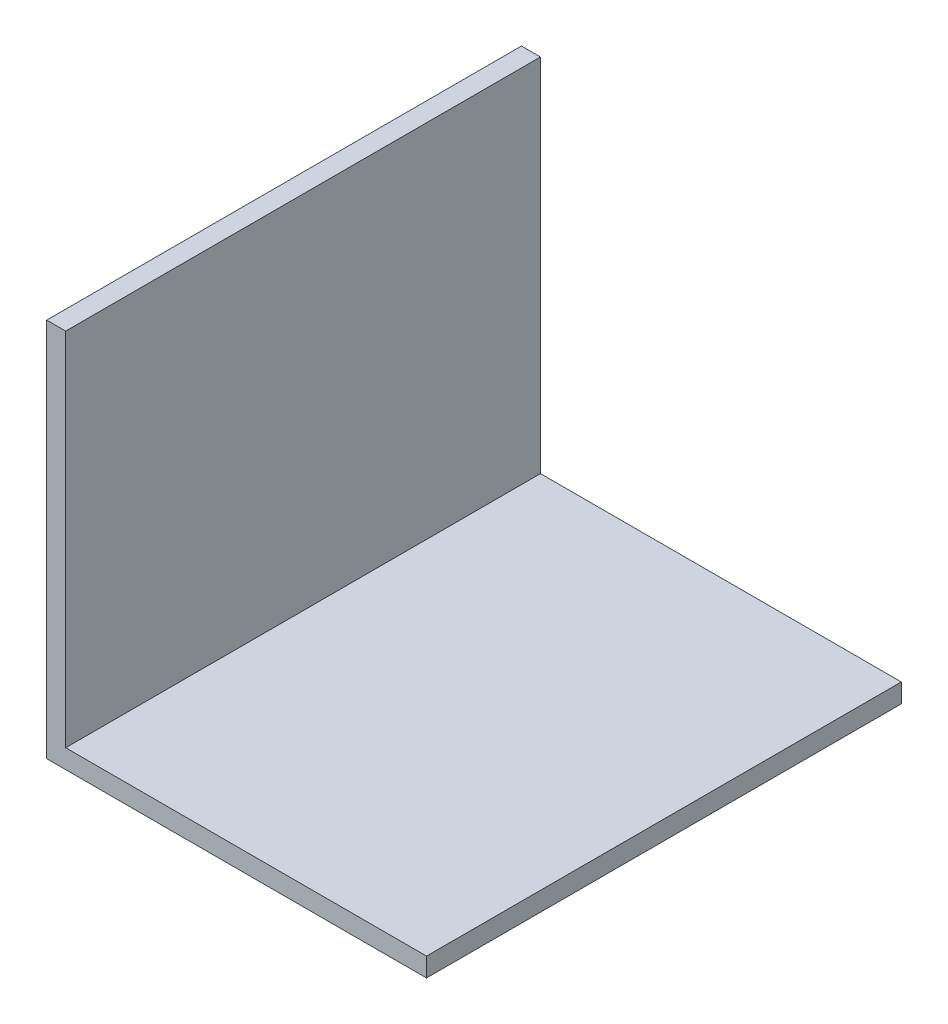
ISO-10303-21;
HEADER;
FILE_DESCRIPTION(('STEP AP214'),'2;1');
FILE_NAME('part.step','',(''),(''),'','','');
FILE_SCHEMA(('AUTOMOTIVE_DESIGN { 1 0 10303 214 1 1 1 1 }'));
ENDSEC;
DATA;
#1=APPLICATION_CONTEXT('core data for automotive mechanical design processes');
#2=APPLICATION_PROTOCOL_DEFINITION('international standard','automotive_design',2000,#1);
#3=PRODUCT_CONTEXT('',#1,'mechanical');
#4=PRODUCT('Part','Part','',(#3));
#5=PRODUCT_RELATED_PRODUCT_CATEGORY('part','',(#4));
#6=PRODUCT_DEFINITION_FORMATION('','',#4);
#7=PRODUCT_DEFINITION_CONTEXT('part definition',#1,'design');
#8=PRODUCT_DEFINITION('design','',#6,#7);
#9=PRODUCT_DEFINITION_SHAPE('','',#8);
#10=(LENGTH_UNIT() NAMED_UNIT(*) SI_UNIT(.MILLI.,.METRE.));
#11=(NAMED_UNIT(*) PLANE_ANGLE_UNIT() SI_UNIT($,.RADIAN.));
#12=(NAMED_UNIT(*) SI_UNIT($,.STERADIAN.) SOLID_ANGLE_UNIT());
#13=UNCERTAINTY_MEASURE_WITH_UNIT(LENGTH_MEASURE(1.E-05),#10,'distance_accuracy_value','');
#14=(GEOMETRIC_REPRESENTATION_CONTEXT(3) GLOBAL_UNCERTAINTY_ASSIGNED_CONTEXT((#13)) GLOBAL_UNIT_ASSIGNED_CONTEXT((#10,
#11,#12)) REPRESENTATION_CONTEXT('',''));
#15=CARTESIAN_POINT('',(0.,0.,0.));
#16=DIRECTION('',(0.,0.,1.));
#17=DIRECTION('',(1.,0.,0.));
#18=AXIS2_PLACEMENT_3D('',#15,#16,#17);
#19=CARTESIAN_POINT('',(0.,40.,50.));
#20=DIRECTION('',(1.,0.,0.));
#21=DIRECTION('',(0.,1.,0.));
#22=AXIS2_PLACEMENT_3D('',#19,#20,#21);
#23=PLANE('',#22);
#24=DIRECTION('',(0.,-1.,0.));
#25=VECTOR('',#24,1.);
#26=CARTESIAN_POINT('',(0.,40.,0.));
#27=LINE('',#26,#25);
#28=CARTESIAN_POINT('',(0.,40.,0.));
#29=VERTEX_POINT('',#28);
#30=CARTESIAN_POINT('',(0.,0.,0.));
#31=VERTEX_POINT('',#30);
#32=EDGE_CURVE('E117',#29,#31,#27,.T.);
#33=ORIENTED_EDGE('',*,*,#32,.T.);
#34=DIRECTION('',(0.,0.,-1.));
#35=VECTOR('',#34,1.);
#36=CARTESIAN_POINT('',(0.,0.,50.));
#37=LINE('',#36,#35);
#38=CARTESIAN_POINT('',(0.,0.,50.));
#39=VERTEX_POINT('',#38);
#40=EDGE_CURVE('E11',#39,#31,#37,.T.);
#41=ORIENTED_EDGE('',*,*,#40,.F.);
#42=DIRECTION('',(0.,-1.,0.));
#43=VECTOR('',#42,1.);
#44=CARTESIAN_POINT('',(0.,40.,50.));
#45=LINE('',#44,#43);
#46=CARTESIAN_POINT('',(0.,40.,50.));
#47=VERTEX_POINT('',#46);
#48=EDGE_CURVE('E127',#47,#39,#45,.T.);
#49=ORIENTED_EDGE('',*,*,#48,.F.);
#50=DIRECTION('',(0.,0.,-1.));
#51=VECTOR('',#50,1.);
#52=CARTESIAN_POINT('',(0.,40.,50.));
#53=LINE('',#52,#51);
#54=EDGE_CURVE('E113',#47,#29,#53,.T.);
#55=ORIENTED_EDGE('',*,*,#54,.T.);
#56=EDGE_LOOP('',(#33,#41,#49,#55));
#57=FACE_BOUND('',#56,.T.);
#58=ADVANCED_FACE('F33',(#57),#23,.F.);
#59=CARTESIAN_POINT('',(0.,0.,50.));
#60=DIRECTION('',(0.,1.,0.));
#61=DIRECTION('',(0.,0.,1.));
#62=AXIS2_PLACEMENT_3D('',#59,#60,#61);
#63=PLANE('',#62);
#64=DIRECTION('',(1.,0.,0.));
#65=VECTOR('',#64,1.);
#66=CARTESIAN_POINT('',(0.,0.,0.));
#67=LINE('',#66,#65);
#68=CARTESIAN_POINT('',(40.,0.,0.));
#69=VERTEX_POINT('',#68);
#70=EDGE_CURVE('E120',#31,#69,#67,.T.);
#71=ORIENTED_EDGE('',*,*,#70,.T.);
#72=DIRECTION('',(0.,0.,-1.));
#73=VECTOR('',#72,1.);
#74=CARTESIAN_POINT('',(40.,0.,50.));
#75=LINE('',#74,#73);
#76=CARTESIAN_POINT('',(40.,0.,50.));
#77=VERTEX_POINT('',#76);
#78=EDGE_CURVE('E41',#77,#69,#75,.T.);
#79=ORIENTED_EDGE('',*,*,#78,.F.);
#80=DIRECTION('',(1.,0.,0.));
#81=VECTOR('',#80,1.);
#82=CARTESIAN_POINT('',(0.,0.,50.));
#83=LINE('',#82,#81);
#84=EDGE_CURVE('E86',#39,#77,#83,.T.);
#85=ORIENTED_EDGE('',*,*,#84,.F.);
#86=ORIENTED_EDGE('',*,*,#40,.T.);
#87=EDGE_LOOP('',(#71,#79,#85,#86));
#88=FACE_BOUND('',#87,.T.);
#89=ADVANCED_FACE('F151',(#88),#63,.F.);
#90=CARTESIAN_POINT('',(40.,0.,50.));
#91=DIRECTION('',(-1.,0.,0.));
#92=DIRECTION('',(0.,0.,1.));
#93=AXIS2_PLACEMENT_3D('',#90,#91,#92);
#94=PLANE('',#93);
#95=DIRECTION('',(0.,1.,0.));
#96=VECTOR('',#95,1.);
#97=CARTESIAN_POINT('',(40.,0.,0.));
#98=LINE('',#97,#96);
#99=CARTESIAN_POINT('',(40.,2.,0.));
#100=VERTEX_POINT('',#99);
#101=EDGE_CURVE('E122',#69,#100,#98,.T.);
#102=ORIENTED_EDGE('',*,*,#101,.T.);
#103=DIRECTION('',(0.,0.,-1.));
#104=VECTOR('',#103,1.);
#105=CARTESIAN_POINT('',(40.,2.,50.));
#106=LINE('',#105,#104);
#107=CARTESIAN_POINT('',(40.,2.,50.));
#108=VERTEX_POINT('',#107);
#109=EDGE_CURVE('E108',#108,#100,#106,.T.);
#110=ORIENTED_EDGE('',*,*,#109,.F.);
#111=DIRECTION('',(0.,1.,0.));
#112=VECTOR('',#111,1.);
#113=CARTESIAN_POINT('',(40.,0.,50.));
#114=LINE('',#113,#112);
#115=EDGE_CURVE('E99',#77,#108,#114,.T.);
#116=ORIENTED_EDGE('',*,*,#115,.F.);
#117=ORIENTED_EDGE('',*,*,#78,.T.);
#118=EDGE_LOOP('',(#102,#110,#116,#117));
#119=FACE_BOUND('',#118,.T.);
#120=ADVANCED_FACE('F133',(#119),#94,.F.);
#121=CARTESIAN_POINT('',(40.,2.,50.));
#122=DIRECTION('',(0.,-1.,0.));
#123=DIRECTION('',(1.,0.,0.));
#124=AXIS2_PLACEMENT_3D('',#121,#122,#123);
#125=PLANE('',#124);
#126=DIRECTION('',(-1.,0.,0.));
#127=VECTOR('',#126,1.);
#128=CARTESIAN_POINT('',(40.,2.,0.));
#129=LINE('',#128,#127);
#130=CARTESIAN_POINT('',(2.,1.99999999999999,0.));
#131=VERTEX_POINT('',#130);
#132=EDGE_CURVE('E107',#100,#131,#129,.T.);
#133=ORIENTED_EDGE('',*,*,#132,.T.);
#134=DIRECTION('',(0.,0.,-1.));
#135=VECTOR('',#134,1.);
#136=CARTESIAN_POINT('',(2.,1.99999999999999,50.));
#137=LINE('',#136,#135);
#138=CARTESIAN_POINT('',(2.,1.99999999999999,50.));
#139=VERTEX_POINT('',#138);
#140=EDGE_CURVE('E104',#139,#131,#137,.T.);
#141=ORIENTED_EDGE('',*,*,#140,.F.);
#142=DIRECTION('',(-1.,0.,0.));
#143=VECTOR('',#142,1.);
#144=CARTESIAN_POINT('',(40.,2.,50.));
#145=LINE('',#144,#143);
#146=EDGE_CURVE('E93',#108,#139,#145,.T.);
#147=ORIENTED_EDGE('',*,*,#146,.F.);
#148=ORIENTED_EDGE('',*,*,#109,.T.);
#149=EDGE_LOOP('',(#133,#141,#147,#148));
#150=FACE_BOUND('',#149,.T.);
#151=ADVANCED_FACE('F105',(#150),#125,.F.);
#152=CARTESIAN_POINT('',(2.,1.99999999999999,50.));
#153=DIRECTION('',(-1.,0.,0.));
#154=DIRECTION('',(0.,-1.,0.));
#155=AXIS2_PLACEMENT_3D('',#152,#153,#154);
#156=PLANE('',#155);
#157=DIRECTION('',(0.,1.,0.));
#158=VECTOR('',#157,1.);
#159=CARTESIAN_POINT('',(2.,1.99999999999999,0.));
#160=LINE('',#159,#158);
#161=CARTESIAN_POINT('',(2.,40.,0.));
#162=VERTEX_POINT('',#161);
#163=EDGE_CURVE('E72',#131,#162,#160,.T.);
#164=ORIENTED_EDGE('',*,*,#163,.T.);
#165=DIRECTION('',(0.,0.,-1.));
#166=VECTOR('',#165,1.);
#167=CARTESIAN_POINT('',(2.,40.,50.));
#168=LINE('',#167,#166);
#169=CARTESIAN_POINT('',(2.,40.,50.));
#170=VERTEX_POINT('',#169);
#171=EDGE_CURVE('E109',#170,#162,#168,.T.);
#172=ORIENTED_EDGE('',*,*,#171,.F.);
#173=DIRECTION('',(0.,1.,0.));
#174=VECTOR('',#173,1.);
#175=CARTESIAN_POINT('',(2.,1.99999999999999,50.));
#176=LINE('',#175,#174);
#177=EDGE_CURVE('E97',#139,#170,#176,.T.);
#178=ORIENTED_EDGE('',*,*,#177,.F.);
#179=ORIENTED_EDGE('',*,*,#140,.T.);
#180=EDGE_LOOP('',(#164,#172,#178,#179));
#181=FACE_BOUND('',#180,.T.);
#182=ADVANCED_FACE('F111',(#181),#156,.F.);
#183=CARTESIAN_POINT('',(2.,40.,50.));
#184=DIRECTION('',(0.,-1.,0.));
#185=DIRECTION('',(0.,0.,-1.));
#186=AXIS2_PLACEMENT_3D('',#183,#184,#185);
#187=PLANE('',#186);
#188=DIRECTION('',(-1.,0.,0.));
#189=VECTOR('',#188,1.);
#190=CARTESIAN_POINT('',(2.,40.,0.));
#191=LINE('',#190,#189);
#192=EDGE_CURVE('E78',#162,#29,#191,.T.);
#193=ORIENTED_EDGE('',*,*,#192,.T.);
#194=ORIENTED_EDGE('',*,*,#54,.F.);
#195=DIRECTION('',(-1.,0.,0.));
#196=VECTOR('',#195,1.);
#197=CARTESIAN_POINT('',(2.,40.,50.));
#198=LINE('',#197,#196);
#199=EDGE_CURVE('E49',#170,#47,#198,.T.);
#200=ORIENTED_EDGE('',*,*,#199,.F.);
#201=ORIENTED_EDGE('',*,*,#171,.T.);
#202=EDGE_LOOP('',(#193,#194,#200,#201));
#203=FACE_BOUND('',#202,.T.);
#204=ADVANCED_FACE('F140',(#203),#187,.F.);
#205=CARTESIAN_POINT('',(0.,0.,50.));
#206=DIRECTION('',(0.,0.,1.));
#207=DIRECTION('',(1.,0.,0.));
#208=AXIS2_PLACEMENT_3D('',#205,#206,#207);
#209=PLANE('',#208);
#210=ORIENTED_EDGE('',*,*,#48,.T.);
#211=ORIENTED_EDGE('',*,*,#84,.T.);
#212=ORIENTED_EDGE('',*,*,#115,.T.);
#213=ORIENTED_EDGE('',*,*,#146,.T.);
#214=ORIENTED_EDGE('',*,*,#177,.T.);
#215=ORIENTED_EDGE('',*,*,#199,.T.);
#216=EDGE_LOOP('',(#210,#211,#212,#213,#214,#215));
#217=FACE_BOUND('',#216,.T.);
#218=ADVANCED_FACE('F95',(#217),#209,.T.);
#219=CARTESIAN_POINT('',(0.,0.,0.));
#220=DIRECTION('',(0.,0.,1.));
#221=DIRECTION('',(1.,0.,0.));
#222=AXIS2_PLACEMENT_3D('',#219,#220,#221);
#223=PLANE('',#222);
#224=ORIENTED_EDGE('',*,*,#32,.F.);
#225=ORIENTED_EDGE('',*,*,#192,.F.);
#226=ORIENTED_EDGE('',*,*,#163,.F.);
#227=ORIENTED_EDGE('',*,*,#132,.F.);
#228=ORIENTED_EDGE('',*,*,#101,.F.);
#229=ORIENTED_EDGE('',*,*,#70,.F.);
#230=EDGE_LOOP('',(#224,#225,#226,#227,#228,#229));
#231=FACE_BOUND('',#230,.T.);
#232=ADVANCED_FACE('F136',(#231),#223,.F.);
#233=CLOSED_SHELL('',(#58,#89,#120,#151,#182,#204,#218,#232));
#234=MANIFOLD_SOLID_BREP('B2',#233);
#235=ADVANCED_BREP_SHAPE_REPRESENTATION('',(#18,#234),#14);
#236=SHAPE_DEFINITION_REPRESENTATION(#9,#235);
ENDSEC;
END-ISO-10303-21;
